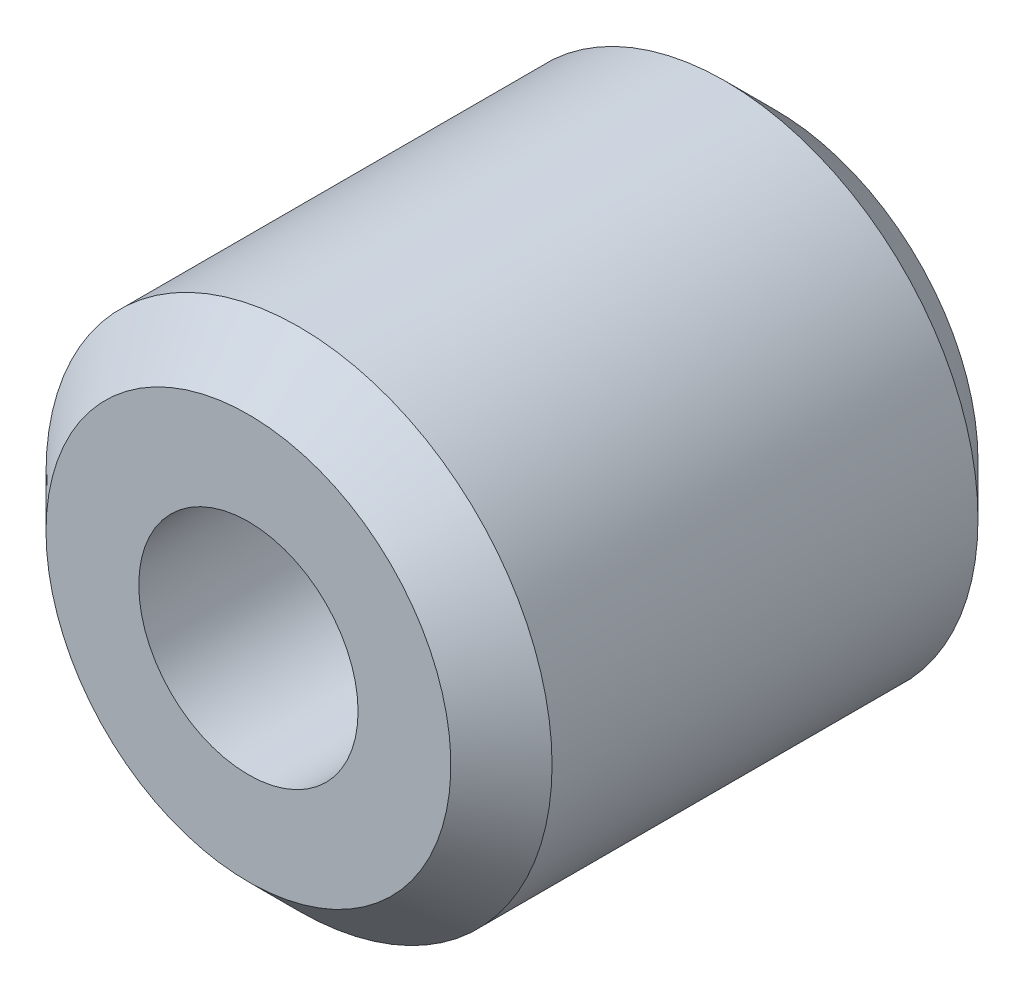
ISO-10303-21;
HEADER;
FILE_DESCRIPTION(('STEP AP214'),'2;1');
FILE_NAME('part.step','',(''),(''),'','','');
FILE_SCHEMA(('AUTOMOTIVE_DESIGN { 1 0 10303 214 1 1 1 1 }'));
ENDSEC;
DATA;
#1=APPLICATION_CONTEXT('core data for automotive mechanical design processes');
#2=APPLICATION_PROTOCOL_DEFINITION('international standard','automotive_design',2000,#1);
#3=PRODUCT_CONTEXT('',#1,'mechanical');
#4=PRODUCT('Part','Part','',(#3));
#5=PRODUCT_RELATED_PRODUCT_CATEGORY('part','',(#4));
#6=PRODUCT_DEFINITION_FORMATION('','',#4);
#7=PRODUCT_DEFINITION_CONTEXT('part definition',#1,'design');
#8=PRODUCT_DEFINITION('design','',#6,#7);
#9=PRODUCT_DEFINITION_SHAPE('','',#8);
#10=(LENGTH_UNIT() NAMED_UNIT(*) SI_UNIT(.MILLI.,.METRE.));
#11=(NAMED_UNIT(*) PLANE_ANGLE_UNIT() SI_UNIT($,.RADIAN.));
#12=(NAMED_UNIT(*) SI_UNIT($,.STERADIAN.) SOLID_ANGLE_UNIT());
#13=UNCERTAINTY_MEASURE_WITH_UNIT(LENGTH_MEASURE(1.E-05),#10,'distance_accuracy_value','');
#14=(GEOMETRIC_REPRESENTATION_CONTEXT(3) GLOBAL_UNCERTAINTY_ASSIGNED_CONTEXT((#13)) GLOBAL_UNIT_ASSIGNED_CONTEXT((#10,
#11,#12)) REPRESENTATION_CONTEXT('',''));
#15=CARTESIAN_POINT('',(0.,0.,0.));
#16=DIRECTION('',(0.,0.,1.));
#17=DIRECTION('',(1.,0.,0.));
#18=AXIS2_PLACEMENT_3D('',#15,#16,#17);
#19=CARTESIAN_POINT('',(0.,0.,-3.125));
#20=DIRECTION('',(0.,0.,1.));
#21=DIRECTION('',(1.,0.,0.));
#22=AXIS2_PLACEMENT_3D('',#19,#20,#21);
#23=CYLINDRICAL_SURFACE('',#22,1.3);
#24=CARTESIAN_POINT('',(0.,0.,-3.125));
#25=DIRECTION('',(0.,0.,1.));
#26=DIRECTION('',(1.,0.,0.));
#27=AXIS2_PLACEMENT_3D('',#24,#25,#26);
#28=CIRCLE('',#27,1.3);
#29=CARTESIAN_POINT('',(1.3,0.,-3.125));
#30=VERTEX_POINT('',#29);
#31=EDGE_CURVE('E17',#30,#30,#28,.F.);
#32=ORIENTED_EDGE('',*,*,#31,.T.);
#33=EDGE_LOOP('',(#32));
#34=FACE_BOUND('',#33,.T.);
#35=CARTESIAN_POINT('',(0.,0.,3.125));
#36=DIRECTION('',(0.,0.,1.));
#37=DIRECTION('',(1.,0.,0.));
#38=AXIS2_PLACEMENT_3D('',#35,#36,#37);
#39=CIRCLE('',#38,1.3);
#40=CARTESIAN_POINT('',(1.3,0.,3.125));
#41=VERTEX_POINT('',#40);
#42=EDGE_CURVE('E33',#41,#41,#39,.F.);
#43=ORIENTED_EDGE('',*,*,#42,.F.);
#44=EDGE_LOOP('',(#43));
#45=FACE_BOUND('',#44,.T.);
#46=ADVANCED_FACE('F14',(#34,#45),#23,.F.);
#47=CARTESIAN_POINT('',(0.,0.,-3.125));
#48=DIRECTION('',(0.,0.,1.));
#49=DIRECTION('',(1.,0.,0.));
#50=AXIS2_PLACEMENT_3D('',#47,#48,#49);
#51=PLANE('',#50);
#52=CARTESIAN_POINT('',(0.,0.,-3.12500005736638));
#53=DIRECTION('',(0.,0.,1.));
#54=DIRECTION('',(1.,0.,0.));
#55=AXIS2_PLACEMENT_3D('',#52,#53,#54);
#56=CIRCLE('',#55,2.39999989861417);
#57=CARTESIAN_POINT('',(2.39999989861417,0.,-3.12500005736638));
#58=VERTEX_POINT('',#57);
#59=EDGE_CURVE('E31',#58,#58,#56,.T.);
#60=ORIENTED_EDGE('',*,*,#59,.F.);
#61=EDGE_LOOP('',(#60));
#62=FACE_BOUND('',#61,.T.);
#63=ORIENTED_EDGE('',*,*,#31,.F.);
#64=EDGE_LOOP('',(#63));
#65=FACE_BOUND('',#64,.T.);
#66=ADVANCED_FACE('F42',(#62,#65),#51,.F.);
#67=CARTESIAN_POINT('',(0.,0.,3.125));
#68=DIRECTION('',(0.,0.,1.));
#69=DIRECTION('',(1.,0.,0.));
#70=AXIS2_PLACEMENT_3D('',#67,#68,#69);
#71=PLANE('',#70);
#72=CARTESIAN_POINT('',(0.,0.,3.12500005736638));
#73=DIRECTION('',(0.,0.,-1.));
#74=DIRECTION('',(-1.,0.,0.));
#75=AXIS2_PLACEMENT_3D('',#72,#73,#74);
#76=CIRCLE('',#75,2.39999989861417);
#77=CARTESIAN_POINT('',(-2.39999989861417,0.,3.12500005736638));
#78=VERTEX_POINT('',#77);
#79=EDGE_CURVE('E26',#78,#78,#76,.T.);
#80=ORIENTED_EDGE('',*,*,#79,.F.);
#81=EDGE_LOOP('',(#80));
#82=FACE_BOUND('',#81,.T.);
#83=ORIENTED_EDGE('',*,*,#42,.T.);
#84=EDGE_LOOP('',(#83));
#85=FACE_BOUND('',#84,.T.);
#86=ADVANCED_FACE('F44',(#82,#85),#71,.T.);
#87=CARTESIAN_POINT('',(0.,0.,-2.52499979956156));
#88=DIRECTION('',(0.,0.,1.));
#89=DIRECTION('',(1.,0.,0.));
#90=AXIS2_PLACEMENT_3D('',#87,#88,#89);
#91=CONICAL_SURFACE('',#90,3.00000014533452,0.785398154160397);
#92=CARTESIAN_POINT('',(0.,0.,-2.524999799354));
#93=DIRECTION('',(0.,0.,1.));
#94=DIRECTION('',(1.,0.,0.));
#95=AXIS2_PLACEMENT_3D('',#92,#93,#94);
#96=CIRCLE('',#95,3.);
#97=CARTESIAN_POINT('',(3.,0.,-2.524999799354));
#98=VERTEX_POINT('',#97);
#99=EDGE_CURVE('E21',#98,#98,#96,.T.);
#100=ORIENTED_EDGE('',*,*,#99,.F.);
#101=EDGE_LOOP('',(#100));
#102=FACE_BOUND('',#101,.T.);
#103=ORIENTED_EDGE('',*,*,#59,.T.);
#104=EDGE_LOOP('',(#103));
#105=FACE_BOUND('',#104,.T.);
#106=ADVANCED_FACE('F51',(#102,#105),#91,.T.);
#107=CARTESIAN_POINT('',(0.,0.,2.52499979956156));
#108=DIRECTION('',(0.,0.,-1.));
#109=DIRECTION('',(-1.,0.,0.));
#110=AXIS2_PLACEMENT_3D('',#107,#108,#109);
#111=CONICAL_SURFACE('',#110,3.00000014533452,0.785398154160397);
#112=CARTESIAN_POINT('',(0.,0.,2.524999799354));
#113=DIRECTION('',(0.,0.,1.));
#114=DIRECTION('',(1.,0.,0.));
#115=AXIS2_PLACEMENT_3D('',#112,#113,#114);
#116=CIRCLE('',#115,3.);
#117=CARTESIAN_POINT('',(3.,0.,2.524999799354));
#118=VERTEX_POINT('',#117);
#119=EDGE_CURVE('E10',#118,#118,#116,.F.);
#120=ORIENTED_EDGE('',*,*,#119,.F.);
#121=EDGE_LOOP('',(#120));
#122=FACE_BOUND('',#121,.T.);
#123=ORIENTED_EDGE('',*,*,#79,.T.);
#124=EDGE_LOOP('',(#123));
#125=FACE_BOUND('',#124,.T.);
#126=ADVANCED_FACE('F58',(#122,#125),#111,.T.);
#127=CARTESIAN_POINT('',(0.,0.,-3.125));
#128=DIRECTION('',(0.,0.,1.));
#129=DIRECTION('',(1.,0.,0.));
#130=AXIS2_PLACEMENT_3D('',#127,#128,#129);
#131=CYLINDRICAL_SURFACE('',#130,3.);
#132=ORIENTED_EDGE('',*,*,#119,.T.);
#133=EDGE_LOOP('',(#132));
#134=FACE_BOUND('',#133,.T.);
#135=ORIENTED_EDGE('',*,*,#99,.T.);
#136=EDGE_LOOP('',(#135));
#137=FACE_BOUND('',#136,.T.);
#138=ADVANCED_FACE('F56',(#134,#137),#131,.T.);
#139=CLOSED_SHELL('',(#46,#66,#86,#106,#126,#138));
#140=MANIFOLD_SOLID_BREP('B1',#139);
#141=ADVANCED_BREP_SHAPE_REPRESENTATION('',(#18,#140),#14);
#142=SHAPE_DEFINITION_REPRESENTATION(#9,#141);
ENDSEC;
END-ISO-10303-21;
